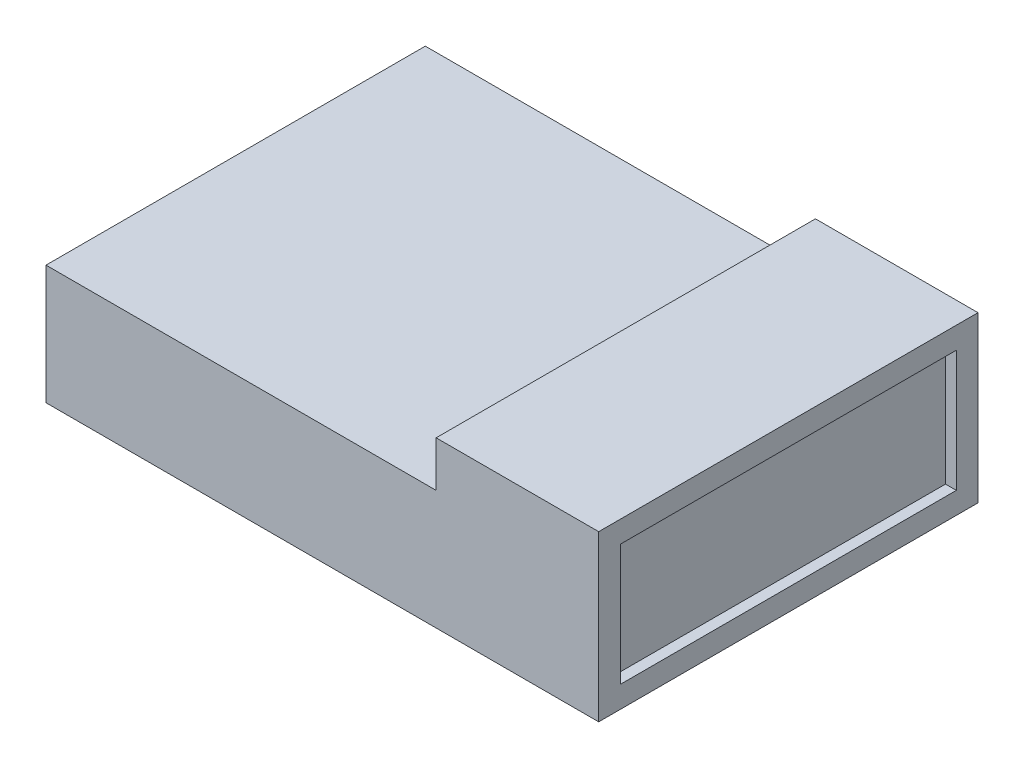
ISO-10303-21;
HEADER;
FILE_DESCRIPTION(('STEP AP214'),'2;1');
FILE_NAME('part.step','',(''),(''),'','','');
FILE_SCHEMA(('AUTOMOTIVE_DESIGN { 1 0 10303 214 1 1 1 1 }'));
ENDSEC;
DATA;
#1=APPLICATION_CONTEXT('core data for automotive mechanical design processes');
#2=APPLICATION_PROTOCOL_DEFINITION('international standard','automotive_design',2000,#1);
#3=PRODUCT_CONTEXT('',#1,'mechanical');
#4=PRODUCT('Part','Part','',(#3));
#5=PRODUCT_RELATED_PRODUCT_CATEGORY('part','',(#4));
#6=PRODUCT_DEFINITION_FORMATION('','',#4);
#7=PRODUCT_DEFINITION_CONTEXT('part definition',#1,'design');
#8=PRODUCT_DEFINITION('design','',#6,#7);
#9=PRODUCT_DEFINITION_SHAPE('','',#8);
#10=(LENGTH_UNIT() NAMED_UNIT(*) SI_UNIT(.MILLI.,.METRE.));
#11=(NAMED_UNIT(*) PLANE_ANGLE_UNIT() SI_UNIT($,.RADIAN.));
#12=(NAMED_UNIT(*) SI_UNIT($,.STERADIAN.) SOLID_ANGLE_UNIT());
#13=UNCERTAINTY_MEASURE_WITH_UNIT(LENGTH_MEASURE(1.E-05),#10,'distance_accuracy_value','');
#14=(GEOMETRIC_REPRESENTATION_CONTEXT(3) GLOBAL_UNCERTAINTY_ASSIGNED_CONTEXT((#13)) GLOBAL_UNIT_ASSIGNED_CONTEXT((#10,
#11,#12)) REPRESENTATION_CONTEXT('',''));
#15=CARTESIAN_POINT('',(0.,0.,0.));
#16=DIRECTION('',(0.,0.,1.));
#17=DIRECTION('',(1.,0.,0.));
#18=AXIS2_PLACEMENT_3D('',#15,#16,#17);
#19=CARTESIAN_POINT('',(0.,11.,-17.5));
#20=DIRECTION('',(0.,0.,-1.));
#21=DIRECTION('',(-1.,0.,0.));
#22=AXIS2_PLACEMENT_3D('',#19,#20,#21);
#23=PLANE('',#22);
#24=DIRECTION('',(1.,0.,0.));
#25=VECTOR('',#24,1.);
#26=CARTESIAN_POINT('',(0.,0.,-17.5));
#27=LINE('',#26,#25);
#28=CARTESIAN_POINT('',(-25.5,0.,-17.5));
#29=VERTEX_POINT('',#28);
#30=CARTESIAN_POINT('',(25.5,0.,-17.5));
#31=VERTEX_POINT('',#30);
#32=EDGE_CURVE('E189',#29,#31,#27,.T.);
#33=ORIENTED_EDGE('',*,*,#32,.F.);
#34=DIRECTION('',(0.,-1.,0.));
#35=VECTOR('',#34,1.);
#36=CARTESIAN_POINT('',(-25.5,11.,-17.5));
#37=LINE('',#36,#35);
#38=CARTESIAN_POINT('',(-25.5,11.,-17.5));
#39=VERTEX_POINT('',#38);
#40=EDGE_CURVE('E11',#39,#29,#37,.T.);
#41=ORIENTED_EDGE('',*,*,#40,.F.);
#42=DIRECTION('',(1.,0.,0.));
#43=VECTOR('',#42,1.);
#44=CARTESIAN_POINT('',(0.,11.,-17.5));
#45=LINE('',#44,#43);
#46=CARTESIAN_POINT('',(10.5,11.,-17.5));
#47=VERTEX_POINT('',#46);
#48=EDGE_CURVE('E191',#39,#47,#45,.T.);
#49=ORIENTED_EDGE('',*,*,#48,.T.);
#50=DIRECTION('',(0.,-1.,0.));
#51=VECTOR('',#50,1.);
#52=CARTESIAN_POINT('',(10.5,15.2,-17.5));
#53=LINE('',#52,#51);
#54=CARTESIAN_POINT('',(10.5,15.2,-17.5));
#55=VERTEX_POINT('',#54);
#56=EDGE_CURVE('E186',#55,#47,#53,.T.);
#57=ORIENTED_EDGE('',*,*,#56,.F.);
#58=DIRECTION('',(1.,0.,0.));
#59=VECTOR('',#58,1.);
#60=CARTESIAN_POINT('',(0.,15.2,-17.5));
#61=LINE('',#60,#59);
#62=CARTESIAN_POINT('',(25.5,15.2,-17.5));
#63=VERTEX_POINT('',#62);
#64=EDGE_CURVE('E165',#55,#63,#61,.T.);
#65=ORIENTED_EDGE('',*,*,#64,.T.);
#66=DIRECTION('',(0.,-1.,0.));
#67=VECTOR('',#66,1.);
#68=CARTESIAN_POINT('',(25.5,15.2,-17.5));
#69=LINE('',#68,#67);
#70=EDGE_CURVE('E175',#63,#31,#69,.T.);
#71=ORIENTED_EDGE('',*,*,#70,.T.);
#72=EDGE_LOOP('',(#33,#41,#49,#57,#65,#71));
#73=FACE_BOUND('',#72,.T.);
#74=ADVANCED_FACE('F43',(#73),#23,.T.);
#75=CARTESIAN_POINT('',(-25.5,11.,0.));
#76=DIRECTION('',(1.,0.,0.));
#77=DIRECTION('',(0.,0.,-1.));
#78=AXIS2_PLACEMENT_3D('',#75,#76,#77);
#79=PLANE('',#78);
#80=DIRECTION('',(0.,0.,1.));
#81=VECTOR('',#80,1.);
#82=CARTESIAN_POINT('',(-25.5,0.,0.));
#83=LINE('',#82,#81);
#84=CARTESIAN_POINT('',(-25.5,0.,17.5));
#85=VERTEX_POINT('',#84);
#86=EDGE_CURVE('E79',#29,#85,#83,.T.);
#87=ORIENTED_EDGE('',*,*,#86,.T.);
#88=DIRECTION('',(0.,-1.,0.));
#89=VECTOR('',#88,1.);
#90=CARTESIAN_POINT('',(-25.5,11.,17.5));
#91=LINE('',#90,#89);
#92=CARTESIAN_POINT('',(-25.5,11.,17.5));
#93=VERTEX_POINT('',#92);
#94=EDGE_CURVE('E50',#93,#85,#91,.T.);
#95=ORIENTED_EDGE('',*,*,#94,.F.);
#96=DIRECTION('',(0.,0.,1.));
#97=VECTOR('',#96,1.);
#98=CARTESIAN_POINT('',(-25.5,11.,0.));
#99=LINE('',#98,#97);
#100=EDGE_CURVE('E66',#39,#93,#99,.T.);
#101=ORIENTED_EDGE('',*,*,#100,.F.);
#102=ORIENTED_EDGE('',*,*,#40,.T.);
#103=EDGE_LOOP('',(#87,#95,#101,#102));
#104=FACE_BOUND('',#103,.T.);
#105=ADVANCED_FACE('F228',(#104),#79,.F.);
#106=CARTESIAN_POINT('',(0.,11.,17.5));
#107=DIRECTION('',(0.,0.,-1.));
#108=DIRECTION('',(-1.,0.,0.));
#109=AXIS2_PLACEMENT_3D('',#106,#107,#108);
#110=PLANE('',#109);
#111=DIRECTION('',(1.,0.,0.));
#112=VECTOR('',#111,1.);
#113=CARTESIAN_POINT('',(0.,0.,17.5));
#114=LINE('',#113,#112);
#115=CARTESIAN_POINT('',(25.5,0.,17.5));
#116=VERTEX_POINT('',#115);
#117=EDGE_CURVE('E192',#85,#116,#114,.T.);
#118=ORIENTED_EDGE('',*,*,#117,.T.);
#119=DIRECTION('',(0.,-1.,0.));
#120=VECTOR('',#119,1.);
#121=CARTESIAN_POINT('',(25.5,15.2,17.5));
#122=LINE('',#121,#120);
#123=CARTESIAN_POINT('',(25.5,15.2,17.5));
#124=VERTEX_POINT('',#123);
#125=EDGE_CURVE('E180',#124,#116,#122,.T.);
#126=ORIENTED_EDGE('',*,*,#125,.F.);
#127=DIRECTION('',(1.,0.,0.));
#128=VECTOR('',#127,1.);
#129=CARTESIAN_POINT('',(0.,15.2,17.5));
#130=LINE('',#129,#128);
#131=CARTESIAN_POINT('',(10.5,15.2,17.5));
#132=VERTEX_POINT('',#131);
#133=EDGE_CURVE('E170',#132,#124,#130,.T.);
#134=ORIENTED_EDGE('',*,*,#133,.F.);
#135=DIRECTION('',(0.,-1.,0.));
#136=VECTOR('',#135,1.);
#137=CARTESIAN_POINT('',(10.5,15.2,17.5));
#138=LINE('',#137,#136);
#139=CARTESIAN_POINT('',(10.5,11.,17.5));
#140=VERTEX_POINT('',#139);
#141=EDGE_CURVE('E183',#132,#140,#138,.T.);
#142=ORIENTED_EDGE('',*,*,#141,.T.);
#143=DIRECTION('',(1.,0.,0.));
#144=VECTOR('',#143,1.);
#145=CARTESIAN_POINT('',(0.,11.,17.5));
#146=LINE('',#145,#144);
#147=EDGE_CURVE('E195',#93,#140,#146,.T.);
#148=ORIENTED_EDGE('',*,*,#147,.F.);
#149=ORIENTED_EDGE('',*,*,#94,.T.);
#150=EDGE_LOOP('',(#118,#126,#134,#142,#148,#149));
#151=FACE_BOUND('',#150,.T.);
#152=ADVANCED_FACE('F202',(#151),#110,.F.);
#153=CARTESIAN_POINT('',(0.,11.,0.));
#154=DIRECTION('',(0.,1.,0.));
#155=DIRECTION('',(0.,0.,1.));
#156=AXIS2_PLACEMENT_3D('',#153,#154,#155);
#157=PLANE('',#156);
#158=DIRECTION('',(0.,0.,1.));
#159=VECTOR('',#158,1.);
#160=CARTESIAN_POINT('',(10.5,11.,0.));
#161=LINE('',#160,#159);
#162=EDGE_CURVE('E83',#47,#140,#161,.T.);
#163=ORIENTED_EDGE('',*,*,#162,.F.);
#164=ORIENTED_EDGE('',*,*,#48,.F.);
#165=ORIENTED_EDGE('',*,*,#100,.T.);
#166=ORIENTED_EDGE('',*,*,#147,.T.);
#167=EDGE_LOOP('',(#163,#164,#165,#166));
#168=FACE_BOUND('',#167,.T.);
#169=ADVANCED_FACE('F220',(#168),#157,.T.);
#170=CARTESIAN_POINT('',(0.,0.,0.));
#171=DIRECTION('',(0.,1.,0.));
#172=DIRECTION('',(0.,0.,1.));
#173=AXIS2_PLACEMENT_3D('',#170,#171,#172);
#174=PLANE('',#173);
#175=ORIENTED_EDGE('',*,*,#32,.T.);
#176=DIRECTION('',(0.,0.,1.));
#177=VECTOR('',#176,1.);
#178=CARTESIAN_POINT('',(25.5,0.,0.));
#179=LINE('',#178,#177);
#180=EDGE_CURVE('E161',#31,#116,#179,.T.);
#181=ORIENTED_EDGE('',*,*,#180,.T.);
#182=ORIENTED_EDGE('',*,*,#117,.F.);
#183=ORIENTED_EDGE('',*,*,#86,.F.);
#184=EDGE_LOOP('',(#175,#181,#182,#183));
#185=FACE_BOUND('',#184,.T.);
#186=ADVANCED_FACE('F205',(#185),#174,.F.);
#187=CARTESIAN_POINT('',(10.5,15.2,0.));
#188=DIRECTION('',(1.,0.,0.));
#189=DIRECTION('',(0.,0.,-1.));
#190=AXIS2_PLACEMENT_3D('',#187,#188,#189);
#191=PLANE('',#190);
#192=ORIENTED_EDGE('',*,*,#56,.T.);
#193=ORIENTED_EDGE('',*,*,#162,.T.);
#194=ORIENTED_EDGE('',*,*,#141,.F.);
#195=DIRECTION('',(0.,0.,1.));
#196=VECTOR('',#195,1.);
#197=CARTESIAN_POINT('',(10.5,15.2,0.));
#198=LINE('',#197,#196);
#199=EDGE_CURVE('E168',#55,#132,#198,.T.);
#200=ORIENTED_EDGE('',*,*,#199,.F.);
#201=EDGE_LOOP('',(#192,#193,#194,#200));
#202=FACE_BOUND('',#201,.T.);
#203=ADVANCED_FACE('F218',(#202),#191,.F.);
#204=CARTESIAN_POINT('',(25.5,15.2,0.));
#205=DIRECTION('',(1.,0.,0.));
#206=DIRECTION('',(0.,0.,-1.));
#207=AXIS2_PLACEMENT_3D('',#204,#205,#206);
#208=PLANE('',#207);
#209=DIRECTION('',(0.,-1.,0.));
#210=VECTOR('',#209,1.);
#211=CARTESIAN_POINT('',(25.5,13.2,15.5));
#212=LINE('',#211,#210);
#213=CARTESIAN_POINT('',(25.5,13.2,15.5));
#214=VERTEX_POINT('',#213);
#215=CARTESIAN_POINT('',(25.5,2.,15.5));
#216=VERTEX_POINT('',#215);
#217=EDGE_CURVE('E57',#214,#216,#212,.T.);
#218=ORIENTED_EDGE('',*,*,#217,.F.);
#219=DIRECTION('',(0.,0.,1.));
#220=VECTOR('',#219,1.);
#221=CARTESIAN_POINT('',(25.5,13.2,15.5));
#222=LINE('',#221,#220);
#223=CARTESIAN_POINT('',(25.5,13.2,-15.5));
#224=VERTEX_POINT('',#223);
#225=EDGE_CURVE('E146',#224,#214,#222,.T.);
#226=ORIENTED_EDGE('',*,*,#225,.F.);
#227=DIRECTION('',(0.,1.,0.));
#228=VECTOR('',#227,1.);
#229=CARTESIAN_POINT('',(25.5,13.2,-15.5));
#230=LINE('',#229,#228);
#231=CARTESIAN_POINT('',(25.5,2.,-15.5));
#232=VERTEX_POINT('',#231);
#233=EDGE_CURVE('E149',#232,#224,#230,.T.);
#234=ORIENTED_EDGE('',*,*,#233,.F.);
#235=DIRECTION('',(0.,0.,-1.));
#236=VECTOR('',#235,1.);
#237=CARTESIAN_POINT('',(25.5,2.,15.5));
#238=LINE('',#237,#236);
#239=EDGE_CURVE('E155',#216,#232,#238,.T.);
#240=ORIENTED_EDGE('',*,*,#239,.F.);
#241=EDGE_LOOP('',(#218,#226,#234,#240));
#242=FACE_BOUND('',#241,.T.);
#243=ORIENTED_EDGE('',*,*,#180,.F.);
#244=ORIENTED_EDGE('',*,*,#70,.F.);
#245=DIRECTION('',(0.,0.,1.));
#246=VECTOR('',#245,1.);
#247=CARTESIAN_POINT('',(25.5,15.2,0.));
#248=LINE('',#247,#246);
#249=EDGE_CURVE('E172',#63,#124,#248,.T.);
#250=ORIENTED_EDGE('',*,*,#249,.T.);
#251=ORIENTED_EDGE('',*,*,#125,.T.);
#252=EDGE_LOOP('',(#243,#244,#250,#251));
#253=FACE_BOUND('',#252,.T.);
#254=ADVANCED_FACE('F209',(#242,#253),#208,.T.);
#255=CARTESIAN_POINT('',(0.,15.2,0.));
#256=DIRECTION('',(0.,1.,0.));
#257=DIRECTION('',(0.,0.,1.));
#258=AXIS2_PLACEMENT_3D('',#255,#256,#257);
#259=PLANE('',#258);
#260=ORIENTED_EDGE('',*,*,#64,.F.);
#261=ORIENTED_EDGE('',*,*,#199,.T.);
#262=ORIENTED_EDGE('',*,*,#133,.T.);
#263=ORIENTED_EDGE('',*,*,#249,.F.);
#264=EDGE_LOOP('',(#260,#261,#262,#263));
#265=FACE_BOUND('',#264,.T.);
#266=ADVANCED_FACE('F215',(#265),#259,.T.);
#267=CARTESIAN_POINT('',(24.5,13.2,15.5));
#268=DIRECTION('',(0.,0.,1.));
#269=DIRECTION('',(0.,-1.,0.));
#270=AXIS2_PLACEMENT_3D('',#267,#268,#269);
#271=PLANE('',#270);
#272=ORIENTED_EDGE('',*,*,#217,.T.);
#273=DIRECTION('',(1.,0.,0.));
#274=VECTOR('',#273,1.);
#275=CARTESIAN_POINT('',(24.5,2.,15.5));
#276=LINE('',#275,#274);
#277=CARTESIAN_POINT('',(24.5,2.,15.5));
#278=VERTEX_POINT('',#277);
#279=EDGE_CURVE('E124',#278,#216,#276,.T.);
#280=ORIENTED_EDGE('',*,*,#279,.F.);
#281=DIRECTION('',(0.,-1.,0.));
#282=VECTOR('',#281,1.);
#283=CARTESIAN_POINT('',(24.5,13.2,15.5));
#284=LINE('',#283,#282);
#285=CARTESIAN_POINT('',(24.5,13.2,15.5));
#286=VERTEX_POINT('',#285);
#287=EDGE_CURVE('E128',#286,#278,#284,.T.);
#288=ORIENTED_EDGE('',*,*,#287,.F.);
#289=DIRECTION('',(1.,0.,0.));
#290=VECTOR('',#289,1.);
#291=CARTESIAN_POINT('',(24.5,13.2,15.5));
#292=LINE('',#291,#290);
#293=EDGE_CURVE('E159',#286,#214,#292,.T.);
#294=ORIENTED_EDGE('',*,*,#293,.T.);
#295=EDGE_LOOP('',(#272,#280,#288,#294));
#296=FACE_BOUND('',#295,.T.);
#297=ADVANCED_FACE('F126',(#296),#271,.F.);
#298=CARTESIAN_POINT('',(24.5,13.2,15.5));
#299=DIRECTION('',(0.,1.,0.));
#300=DIRECTION('',(0.,0.,1.));
#301=AXIS2_PLACEMENT_3D('',#298,#299,#300);
#302=PLANE('',#301);
#303=ORIENTED_EDGE('',*,*,#225,.T.);
#304=ORIENTED_EDGE('',*,*,#293,.F.);
#305=DIRECTION('',(0.,0.,1.));
#306=VECTOR('',#305,1.);
#307=CARTESIAN_POINT('',(24.5,13.2,15.5));
#308=LINE('',#307,#306);
#309=CARTESIAN_POINT('',(24.5,13.2,-15.5));
#310=VERTEX_POINT('',#309);
#311=EDGE_CURVE('E134',#310,#286,#308,.T.);
#312=ORIENTED_EDGE('',*,*,#311,.F.);
#313=DIRECTION('',(1.,0.,0.));
#314=VECTOR('',#313,1.);
#315=CARTESIAN_POINT('',(24.5,13.2,-15.5));
#316=LINE('',#315,#314);
#317=EDGE_CURVE('E162',#310,#224,#316,.T.);
#318=ORIENTED_EDGE('',*,*,#317,.T.);
#319=EDGE_LOOP('',(#303,#304,#312,#318));
#320=FACE_BOUND('',#319,.T.);
#321=ADVANCED_FACE('F307',(#320),#302,.F.);
#322=CARTESIAN_POINT('',(24.5,13.2,-15.5));
#323=DIRECTION('',(0.,0.,-1.));
#324=DIRECTION('',(0.,1.,0.));
#325=AXIS2_PLACEMENT_3D('',#322,#323,#324);
#326=PLANE('',#325);
#327=ORIENTED_EDGE('',*,*,#233,.T.);
#328=ORIENTED_EDGE('',*,*,#317,.F.);
#329=DIRECTION('',(0.,1.,0.));
#330=VECTOR('',#329,1.);
#331=CARTESIAN_POINT('',(24.5,13.2,-15.5));
#332=LINE('',#331,#330);
#333=CARTESIAN_POINT('',(24.5,2.,-15.5));
#334=VERTEX_POINT('',#333);
#335=EDGE_CURVE('E142',#334,#310,#332,.T.);
#336=ORIENTED_EDGE('',*,*,#335,.F.);
#337=DIRECTION('',(1.,0.,0.));
#338=VECTOR('',#337,1.);
#339=CARTESIAN_POINT('',(24.5,2.,-15.5));
#340=LINE('',#339,#338);
#341=EDGE_CURVE('E133',#334,#232,#340,.T.);
#342=ORIENTED_EDGE('',*,*,#341,.T.);
#343=EDGE_LOOP('',(#327,#328,#336,#342));
#344=FACE_BOUND('',#343,.T.);
#345=ADVANCED_FACE('F316',(#344),#326,.F.);
#346=CARTESIAN_POINT('',(24.5,2.,15.5));
#347=DIRECTION('',(0.,-1.,0.));
#348=DIRECTION('',(0.,0.,-1.));
#349=AXIS2_PLACEMENT_3D('',#346,#347,#348);
#350=PLANE('',#349);
#351=ORIENTED_EDGE('',*,*,#239,.T.);
#352=ORIENTED_EDGE('',*,*,#341,.F.);
#353=DIRECTION('',(0.,0.,-1.));
#354=VECTOR('',#353,1.);
#355=CARTESIAN_POINT('',(24.5,2.,15.5));
#356=LINE('',#355,#354);
#357=EDGE_CURVE('E137',#278,#334,#356,.T.);
#358=ORIENTED_EDGE('',*,*,#357,.F.);
#359=ORIENTED_EDGE('',*,*,#279,.T.);
#360=EDGE_LOOP('',(#351,#352,#358,#359));
#361=FACE_BOUND('',#360,.T.);
#362=ADVANCED_FACE('F138',(#361),#350,.F.);
#363=CARTESIAN_POINT('',(24.5,0.,0.));
#364=DIRECTION('',(1.,0.,0.));
#365=DIRECTION('',(0.,0.,-1.));
#366=AXIS2_PLACEMENT_3D('',#363,#364,#365);
#367=PLANE('',#366);
#368=ORIENTED_EDGE('',*,*,#287,.T.);
#369=ORIENTED_EDGE('',*,*,#357,.T.);
#370=ORIENTED_EDGE('',*,*,#335,.T.);
#371=ORIENTED_EDGE('',*,*,#311,.T.);
#372=EDGE_LOOP('',(#368,#369,#370,#371));
#373=FACE_BOUND('',#372,.T.);
#374=ADVANCED_FACE('F144',(#373),#367,.T.);
#375=CLOSED_SHELL('',(#74,#105,#152,#169,#186,#203,#254,#266,#297,#321,#345,#362,#374));
#376=MANIFOLD_SOLID_BREP('B2',#375);
#377=ADVANCED_BREP_SHAPE_REPRESENTATION('',(#18,#376),#14);
#378=SHAPE_DEFINITION_REPRESENTATION(#9,#377);
ENDSEC;
END-ISO-10303-21;
